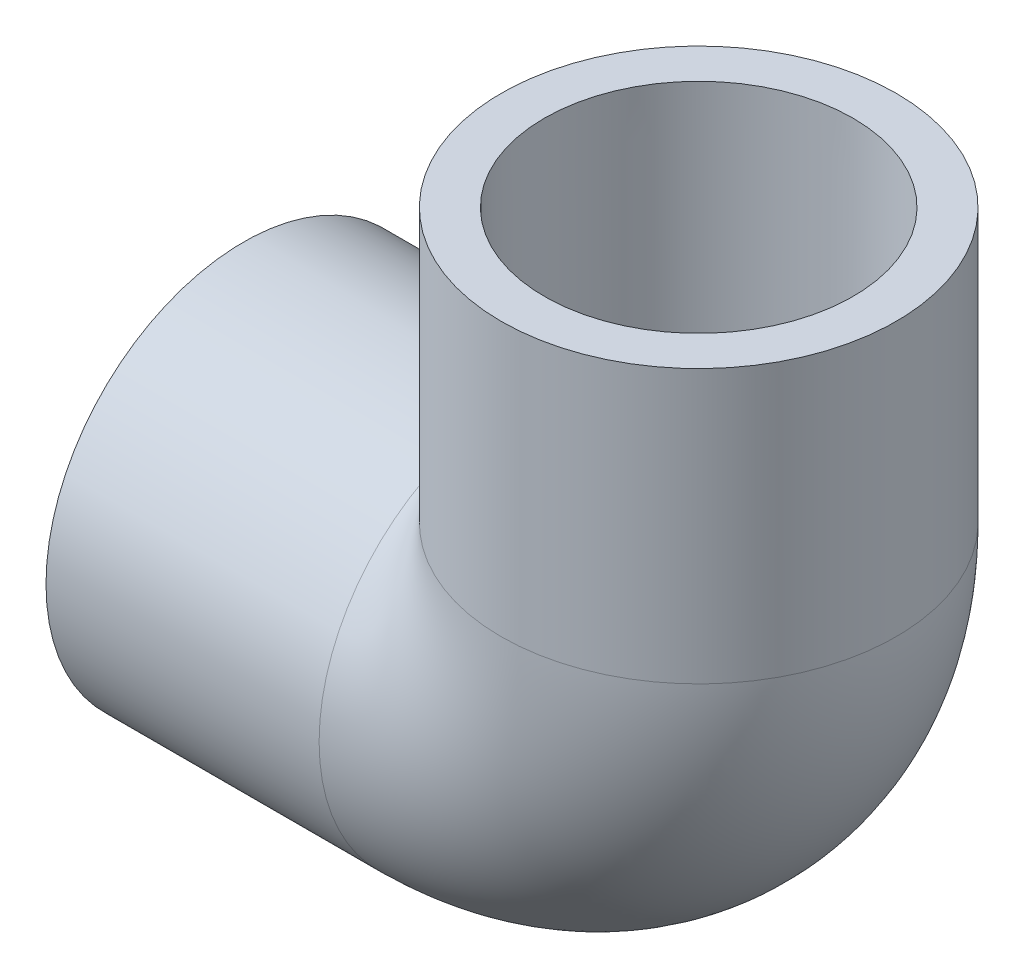
ISO-10303-21;
HEADER;
FILE_DESCRIPTION(('STEP AP214'),'2;1');
FILE_NAME('part.step','',(''),(''),'','','');
FILE_SCHEMA(('AUTOMOTIVE_DESIGN { 1 0 10303 214 1 1 1 1 }'));
ENDSEC;
DATA;
#1=APPLICATION_CONTEXT('core data for automotive mechanical design processes');
#2=APPLICATION_PROTOCOL_DEFINITION('international standard','automotive_design',2000,#1);
#3=PRODUCT_CONTEXT('',#1,'mechanical');
#4=PRODUCT('Part','Part','',(#3));
#5=PRODUCT_RELATED_PRODUCT_CATEGORY('part','',(#4));
#6=PRODUCT_DEFINITION_FORMATION('','',#4);
#7=PRODUCT_DEFINITION_CONTEXT('part definition',#1,'design');
#8=PRODUCT_DEFINITION('design','',#6,#7);
#9=PRODUCT_DEFINITION_SHAPE('','',#8);
#10=(LENGTH_UNIT() NAMED_UNIT(*) SI_UNIT(.MILLI.,.METRE.));
#11=(NAMED_UNIT(*) PLANE_ANGLE_UNIT() SI_UNIT($,.RADIAN.));
#12=(NAMED_UNIT(*) SI_UNIT($,.STERADIAN.) SOLID_ANGLE_UNIT());
#13=UNCERTAINTY_MEASURE_WITH_UNIT(LENGTH_MEASURE(1.E-05),#10,'distance_accuracy_value','');
#14=(GEOMETRIC_REPRESENTATION_CONTEXT(3) GLOBAL_UNCERTAINTY_ASSIGNED_CONTEXT((#13)) GLOBAL_UNIT_ASSIGNED_CONTEXT((#10,
#11,#12)) REPRESENTATION_CONTEXT('',''));
#15=CARTESIAN_POINT('',(0.,0.,0.));
#16=DIRECTION('',(0.,0.,1.));
#17=DIRECTION('',(1.,0.,0.));
#18=AXIS2_PLACEMENT_3D('',#15,#16,#17);
#19=CARTESIAN_POINT('',(-31.75,-13.7795,0.));
#20=DIRECTION('',(-1.,0.,0.));
#21=DIRECTION('',(0.,0.,1.));
#22=AXIS2_PLACEMENT_3D('',#19,#20,#21);
#23=PLANE('',#22);
#24=CARTESIAN_POINT('',(-31.75,0.,0.));
#25=DIRECTION('',(-1.,0.,0.));
#26=DIRECTION('',(0.,0.,1.));
#27=AXIS2_PLACEMENT_3D('',#24,#25,#26);
#28=CIRCLE('',#27,13.7795);
#29=CARTESIAN_POINT('',(-31.75,0.,13.7795));
#30=VERTEX_POINT('',#29);
#31=EDGE_CURVE('E52',#30,#30,#28,.T.);
#32=ORIENTED_EDGE('',*,*,#31,.T.);
#33=EDGE_LOOP('',(#32));
#34=FACE_BOUND('',#33,.T.);
#35=CARTESIAN_POINT('',(-31.75,0.,0.));
#36=DIRECTION('',(-1.,0.,0.));
#37=DIRECTION('',(0.,0.,1.));
#38=AXIS2_PLACEMENT_3D('',#35,#36,#37);
#39=CIRCLE('',#38,10.7696);
#40=CARTESIAN_POINT('',(-31.75,0.,10.7696));
#41=VERTEX_POINT('',#40);
#42=EDGE_CURVE('E39',#41,#41,#39,.T.);
#43=ORIENTED_EDGE('',*,*,#42,.F.);
#44=EDGE_LOOP('',(#43));
#45=FACE_BOUND('',#44,.T.);
#46=ADVANCED_FACE('F32',(#34,#45),#23,.T.);
#47=CARTESIAN_POINT('',(-12.7,0.,0.));
#48=DIRECTION('',(-1.,0.,0.));
#49=DIRECTION('',(0.,0.,1.));
#50=AXIS2_PLACEMENT_3D('',#47,#48,#49);
#51=CONICAL_SURFACE('',#50,10.6172,0.00799982933988648);
#52=ORIENTED_EDGE('',*,*,#42,.T.);
#53=EDGE_LOOP('',(#52));
#54=FACE_BOUND('',#53,.T.);
#55=CARTESIAN_POINT('',(-12.7,0.,0.));
#56=DIRECTION('',(-1.,0.,0.));
#57=DIRECTION('',(0.,0.,1.));
#58=AXIS2_PLACEMENT_3D('',#55,#56,#57);
#59=CIRCLE('',#58,10.6172);
#60=CARTESIAN_POINT('',(-12.7,0.,10.6172));
#61=VERTEX_POINT('',#60);
#62=EDGE_CURVE('E63',#61,#61,#59,.T.);
#63=ORIENTED_EDGE('',*,*,#62,.F.);
#64=EDGE_LOOP('',(#63));
#65=FACE_BOUND('',#64,.T.);
#66=ADVANCED_FACE('F72',(#54,#65),#51,.F.);
#67=CARTESIAN_POINT('',(-31.75,0.,0.));
#68=DIRECTION('',(-1.,0.,0.));
#69=DIRECTION('',(0.,0.,1.));
#70=AXIS2_PLACEMENT_3D('',#67,#68,#69);
#71=CYLINDRICAL_SURFACE('',#70,13.7795);
#72=CARTESIAN_POINT('',(0.,0.,0.));
#73=DIRECTION('',(-0.707106781186547,-0.707106781186547,0.));
#74=DIRECTION('',(-0.707106781186547,0.707106781186547,0.));
#75=AXIS2_PLACEMENT_3D('',#72,#73,#74);
#76=ELLIPSE('',#75,19.4871557827201,13.7795);
#77=CARTESIAN_POINT('',(-12.7,12.7,-5.34645866438711));
#78=VERTEX_POINT('',#77);
#79=CARTESIAN_POINT('',(-12.7,12.7,5.3464586643871));
#80=VERTEX_POINT('',#79);
#81=EDGE_CURVE('E51',#78,#80,#76,.F.);
#82=ORIENTED_EDGE('',*,*,#81,.F.);
#83=CARTESIAN_POINT('',(-12.7,0.,0.));
#84=DIRECTION('',(-1.,0.,0.));
#85=DIRECTION('',(0.,0.,1.));
#86=AXIS2_PLACEMENT_3D('',#83,#84,#85);
#87=CIRCLE('',#86,13.7795);
#88=EDGE_CURVE('E58',#78,#80,#87,.T.);
#89=ORIENTED_EDGE('',*,*,#88,.T.);
#90=EDGE_LOOP('',(#82,#89));
#91=FACE_BOUND('',#90,.T.);
#92=ORIENTED_EDGE('',*,*,#31,.F.);
#93=EDGE_LOOP('',(#92));
#94=FACE_BOUND('',#93,.T.);
#95=ADVANCED_FACE('F56',(#91,#94),#71,.T.);
#96=CARTESIAN_POINT('',(-12.7,12.7,0.));
#97=DIRECTION('',(0.,0.,-1.));
#98=DIRECTION('',(-1.,0.,0.));
#99=AXIS2_PLACEMENT_3D('',#96,#97,#98);
#100=TOROIDAL_SURFACE('',#99,12.7,7.8994);
#101=CARTESIAN_POINT('',(0.,12.7,0.));
#102=DIRECTION('',(0.,1.,0.));
#103=DIRECTION('',(0.,0.,-1.));
#104=AXIS2_PLACEMENT_3D('',#101,#102,#103);
#105=CIRCLE('',#104,7.8994);
#106=CARTESIAN_POINT('',(7.8994,12.7,0.));
#107=VERTEX_POINT('',#106);
#108=EDGE_CURVE('E53',#107,#107,#105,.T.);
#109=CARTESIAN_POINT('',(-12.7,0.,0.));
#110=DIRECTION('',(1.,0.,0.));
#111=DIRECTION('',(0.,0.,-1.));
#112=AXIS2_PLACEMENT_3D('',#109,#110,#111);
#113=CIRCLE('',#112,7.8994);
#114=CARTESIAN_POINT('',(-12.7,-7.8994,0.));
#115=VERTEX_POINT('',#114);
#116=EDGE_CURVE('E59',#115,#115,#113,.T.);
#117=CARTESIAN_POINT('',(-12.7,12.7,0.));
#118=DIRECTION('',(0.,0.,-1.));
#119=DIRECTION('',(-1.,0.,0.));
#120=AXIS2_PLACEMENT_3D('',#117,#118,#119);
#121=CIRCLE('',#120,20.5994);
#122=EDGE_CURVE('',#107,#115,#121,.T.);
#123=ORIENTED_EDGE('',*,*,#108,.T.);
#124=ORIENTED_EDGE('',*,*,#116,.F.);
#125=ORIENTED_EDGE('',*,*,#122,.T.);
#126=ORIENTED_EDGE('',*,*,#122,.F.);
#127=EDGE_LOOP('',(#123,#125,#124,#126));
#128=FACE_BOUND('',#127,.T.);
#129=ADVANCED_FACE('F82',(#128),#100,.F.);
#130=CARTESIAN_POINT('',(-25.4,12.7,0.));
#131=DIRECTION('',(0.,-1.,0.));
#132=DIRECTION('',(-1.,0.,0.));
#133=AXIS2_PLACEMENT_3D('',#130,#131,#132);
#134=CIRCLE('',#133,13.7795);
#135=TRIMMED_CURVE('',#134,(PARAMETER_VALUE(-2.74313105657)),(PARAMETER_VALUE(2.74313105657)),
.T.,.PARAMETER.);
#136=CARTESIAN_POINT('',(-12.7,12.7,0.));
#137=DIRECTION('',(0.,0.,-1.));
#138=AXIS1_PLACEMENT('',#136,#137);
#139=SURFACE_OF_REVOLUTION('',#135,#138);
#140=CARTESIAN_POINT('',(0.,12.7,0.));
#141=DIRECTION('',(0.,1.,0.));
#142=DIRECTION('',(0.,0.,-1.));
#143=AXIS2_PLACEMENT_3D('',#140,#141,#142);
#144=CIRCLE('',#143,13.7795);
#145=EDGE_CURVE('E45',#80,#78,#144,.T.);
#146=ORIENTED_EDGE('',*,*,#145,.F.);
#147=ORIENTED_EDGE('',*,*,#88,.F.);
#148=EDGE_LOOP('',(#146,#147));
#149=FACE_BOUND('',#148,.T.);
#150=ADVANCED_FACE('F62',(#149),#139,.T.);
#151=CARTESIAN_POINT('',(0.,12.7,0.));
#152=DIRECTION('',(0.,1.,0.));
#153=DIRECTION('',(0.,0.,-1.));
#154=AXIS2_PLACEMENT_3D('',#151,#152,#153);
#155=PLANE('',#154);
#156=CARTESIAN_POINT('',(0.,12.7,0.));
#157=DIRECTION('',(0.,1.,0.));
#158=DIRECTION('',(-1.,0.,0.));
#159=AXIS2_PLACEMENT_3D('',#156,#157,#158);
#160=CIRCLE('',#159,10.6172);
#161=CARTESIAN_POINT('',(-10.6172,12.7,0.));
#162=VERTEX_POINT('',#161);
#163=EDGE_CURVE('E11',#162,#162,#160,.F.);
#164=ORIENTED_EDGE('',*,*,#163,.F.);
#165=EDGE_LOOP('',(#164));
#166=FACE_BOUND('',#165,.T.);
#167=ORIENTED_EDGE('',*,*,#108,.F.);
#168=EDGE_LOOP('',(#167));
#169=FACE_BOUND('',#168,.T.);
#170=ADVANCED_FACE('F89',(#166,#169),#155,.T.);
#171=CARTESIAN_POINT('',(-12.7,0.,0.));
#172=DIRECTION('',(1.,0.,0.));
#173=DIRECTION('',(0.,0.,-1.));
#174=AXIS2_PLACEMENT_3D('',#171,#172,#173);
#175=PLANE('',#174);
#176=ORIENTED_EDGE('',*,*,#62,.T.);
#177=EDGE_LOOP('',(#176));
#178=FACE_BOUND('',#177,.T.);
#179=ORIENTED_EDGE('',*,*,#116,.T.);
#180=EDGE_LOOP('',(#179));
#181=FACE_BOUND('',#180,.T.);
#182=ADVANCED_FACE('F92',(#178,#181),#175,.F.);
#183=CARTESIAN_POINT('',(13.7795,31.75,0.));
#184=DIRECTION('',(0.,1.,0.));
#185=DIRECTION('',(0.,0.,1.));
#186=AXIS2_PLACEMENT_3D('',#183,#184,#185);
#187=PLANE('',#186);
#188=CARTESIAN_POINT('',(0.,31.75,0.));
#189=DIRECTION('',(0.,-1.,0.));
#190=DIRECTION('',(0.,0.,-1.));
#191=AXIS2_PLACEMENT_3D('',#188,#189,#190);
#192=CIRCLE('',#191,10.7696);
#193=CARTESIAN_POINT('',(0.,31.75,-10.7696));
#194=VERTEX_POINT('',#193);
#195=EDGE_CURVE('E116',#194,#194,#192,.T.);
#196=ORIENTED_EDGE('',*,*,#195,.T.);
#197=EDGE_LOOP('',(#196));
#198=FACE_BOUND('',#197,.T.);
#199=CARTESIAN_POINT('',(0.,31.75,0.));
#200=DIRECTION('',(0.,-1.,0.));
#201=DIRECTION('',(0.,0.,-1.));
#202=AXIS2_PLACEMENT_3D('',#199,#200,#201);
#203=CIRCLE('',#202,13.7795);
#204=CARTESIAN_POINT('',(0.,31.75,-13.7795));
#205=VERTEX_POINT('',#204);
#206=EDGE_CURVE('E60',#205,#205,#203,.T.);
#207=ORIENTED_EDGE('',*,*,#206,.F.);
#208=EDGE_LOOP('',(#207));
#209=FACE_BOUND('',#208,.T.);
#210=ADVANCED_FACE('F99',(#198,#209),#187,.T.);
#211=CARTESIAN_POINT('',(0.,0.,0.));
#212=DIRECTION('',(0.,-1.,0.));
#213=DIRECTION('',(0.,0.,-1.));
#214=AXIS2_PLACEMENT_3D('',#211,#212,#213);
#215=CYLINDRICAL_SURFACE('',#214,13.7795);
#216=ORIENTED_EDGE('',*,*,#206,.T.);
#217=EDGE_LOOP('',(#216));
#218=FACE_BOUND('',#217,.T.);
#219=ORIENTED_EDGE('',*,*,#145,.T.);
#220=ORIENTED_EDGE('',*,*,#81,.T.);
#221=EDGE_LOOP('',(#219,#220));
#222=FACE_BOUND('',#221,.T.);
#223=ADVANCED_FACE('F50',(#218,#222),#215,.T.);
#224=CARTESIAN_POINT('',(0.,31.75,0.));
#225=DIRECTION('',(0.,1.,0.));
#226=DIRECTION('',(0.,0.,1.));
#227=AXIS2_PLACEMENT_3D('',#224,#225,#226);
#228=CONICAL_SURFACE('',#227,10.7696,0.00799982933988648);
#229=ORIENTED_EDGE('',*,*,#163,.T.);
#230=EDGE_LOOP('',(#229));
#231=FACE_BOUND('',#230,.T.);
#232=ORIENTED_EDGE('',*,*,#195,.F.);
#233=EDGE_LOOP('',(#232));
#234=FACE_BOUND('',#233,.T.);
#235=ADVANCED_FACE('F106',(#231,#234),#228,.F.);
#236=CLOSED_SHELL('',(#46,#66,#95,#129,#150,#170,#182,#210,#223,#235));
#237=MANIFOLD_SOLID_BREP('B2',#236);
#238=ADVANCED_BREP_SHAPE_REPRESENTATION('',(#18,#237),#14);
#239=SHAPE_DEFINITION_REPRESENTATION(#9,#238);
ENDSEC;
END-ISO-10303-21;
